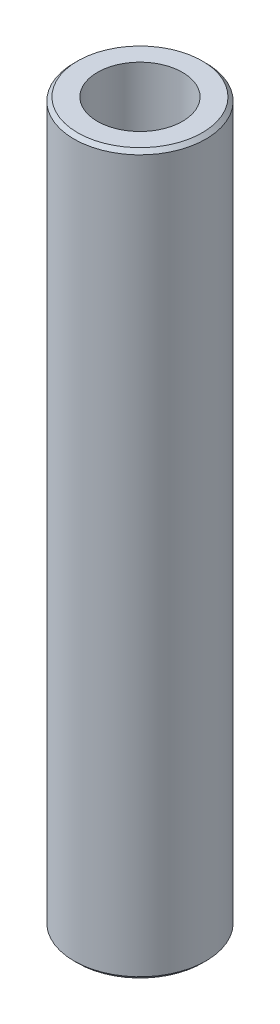
ISO-10303-21;
HEADER;
FILE_DESCRIPTION(('STEP AP214'),'2;1');
FILE_NAME('part.step','',(''),(''),'','','');
FILE_SCHEMA(('AUTOMOTIVE_DESIGN { 1 0 10303 214 1 1 1 1 }'));
ENDSEC;
DATA;
#1=APPLICATION_CONTEXT('core data for automotive mechanical design processes');
#2=APPLICATION_PROTOCOL_DEFINITION('international standard','automotive_design',2000,#1);
#3=PRODUCT_CONTEXT('',#1,'mechanical');
#4=PRODUCT('Part','Part','',(#3));
#5=PRODUCT_RELATED_PRODUCT_CATEGORY('part','',(#4));
#6=PRODUCT_DEFINITION_FORMATION('','',#4);
#7=PRODUCT_DEFINITION_CONTEXT('part definition',#1,'design');
#8=PRODUCT_DEFINITION('design','',#6,#7);
#9=PRODUCT_DEFINITION_SHAPE('','',#8);
#10=(LENGTH_UNIT() NAMED_UNIT(*) SI_UNIT(.MILLI.,.METRE.));
#11=(NAMED_UNIT(*) PLANE_ANGLE_UNIT() SI_UNIT($,.RADIAN.));
#12=(NAMED_UNIT(*) SI_UNIT($,.STERADIAN.) SOLID_ANGLE_UNIT());
#13=UNCERTAINTY_MEASURE_WITH_UNIT(LENGTH_MEASURE(1.E-05),#10,'distance_accuracy_value','');
#14=(GEOMETRIC_REPRESENTATION_CONTEXT(3) GLOBAL_UNCERTAINTY_ASSIGNED_CONTEXT((#13)) GLOBAL_UNIT_ASSIGNED_CONTEXT((#10,
#11,#12)) REPRESENTATION_CONTEXT('',''));
#15=CARTESIAN_POINT('',(0.,0.,0.));
#16=DIRECTION('',(0.,0.,1.));
#17=DIRECTION('',(1.,0.,0.));
#18=AXIS2_PLACEMENT_3D('',#15,#16,#17);
#19=CARTESIAN_POINT('',(0.,600.,0.));
#20=DIRECTION('',(0.,-1.,0.));
#21=DIRECTION('',(0.,0.,-1.));
#22=AXIS2_PLACEMENT_3D('',#19,#20,#21);
#23=CYLINDRICAL_SURFACE('',#22,55.);
#24=CARTESIAN_POINT('',(0.,596.954804541309,0.));
#25=DIRECTION('',(0.,1.,0.));
#26=DIRECTION('',(0.,0.,1.));
#27=AXIS2_PLACEMENT_3D('',#24,#25,#26);
#28=CIRCLE('',#27,55.);
#29=CARTESIAN_POINT('',(0.,596.954804541309,55.));
#30=VERTEX_POINT('',#29);
#31=EDGE_CURVE('E50',#30,#30,#28,.F.);
#32=ORIENTED_EDGE('',*,*,#31,.T.);
#33=EDGE_LOOP('',(#32));
#34=FACE_BOUND('',#33,.T.);
#35=CARTESIAN_POINT('',(0.,3.0451954586912,0.));
#36=DIRECTION('',(0.,1.,0.));
#37=DIRECTION('',(0.,0.,1.));
#38=AXIS2_PLACEMENT_3D('',#35,#36,#37);
#39=CIRCLE('',#38,55.);
#40=CARTESIAN_POINT('',(0.,3.0451954586912,55.));
#41=VERTEX_POINT('',#40);
#42=EDGE_CURVE('E51',#41,#41,#39,.T.);
#43=ORIENTED_EDGE('',*,*,#42,.T.);
#44=EDGE_LOOP('',(#43));
#45=FACE_BOUND('',#44,.T.);
#46=ADVANCED_FACE('F39',(#34,#45),#23,.T.);
#47=CARTESIAN_POINT('',(0.,600.,0.));
#48=DIRECTION('',(0.,1.,0.));
#49=DIRECTION('',(0.,0.,1.));
#50=AXIS2_PLACEMENT_3D('',#47,#48,#49);
#51=PLANE('',#50);
#52=CARTESIAN_POINT('',(0.,600.,0.));
#53=DIRECTION('',(0.,1.,0.));
#54=DIRECTION('',(0.,0.,1.));
#55=AXIS2_PLACEMENT_3D('',#52,#53,#54);
#56=CIRCLE('',#55,51.9548045413087);
#57=CARTESIAN_POINT('',(0.,600.,51.9548045413087));
#58=VERTEX_POINT('',#57);
#59=EDGE_CURVE('E54',#58,#58,#56,.T.);
#60=ORIENTED_EDGE('',*,*,#59,.T.);
#61=EDGE_LOOP('',(#60));
#62=FACE_BOUND('',#61,.T.);
#63=CARTESIAN_POINT('',(0.,600.,0.));
#64=DIRECTION('',(0.,1.,0.));
#65=DIRECTION('',(0.,0.,1.));
#66=AXIS2_PLACEMENT_3D('',#63,#64,#65);
#67=CIRCLE('',#66,35.4763558999587);
#68=CARTESIAN_POINT('',(0.,600.,35.4763558999587));
#69=VERTEX_POINT('',#68);
#70=EDGE_CURVE('E58',#69,#69,#67,.T.);
#71=ORIENTED_EDGE('',*,*,#70,.F.);
#72=EDGE_LOOP('',(#71));
#73=FACE_BOUND('',#72,.T.);
#74=ADVANCED_FACE('F69',(#62,#73),#51,.T.);
#75=CARTESIAN_POINT('',(0.,0.,0.));
#76=DIRECTION('',(0.,1.,0.));
#77=DIRECTION('',(0.,0.,1.));
#78=AXIS2_PLACEMENT_3D('',#75,#76,#77);
#79=PLANE('',#78);
#80=CARTESIAN_POINT('',(0.,0.,0.));
#81=DIRECTION('',(0.,1.,0.));
#82=DIRECTION('',(0.,0.,1.));
#83=AXIS2_PLACEMENT_3D('',#80,#81,#82);
#84=CIRCLE('',#83,51.9548045413088);
#85=CARTESIAN_POINT('',(0.,0.,51.9548045413088));
#86=VERTEX_POINT('',#85);
#87=EDGE_CURVE('E10',#86,#86,#84,.F.);
#88=ORIENTED_EDGE('',*,*,#87,.T.);
#89=EDGE_LOOP('',(#88));
#90=FACE_BOUND('',#89,.T.);
#91=CARTESIAN_POINT('',(0.,0.,0.));
#92=DIRECTION('',(0.,1.,0.));
#93=DIRECTION('',(0.,0.,1.));
#94=AXIS2_PLACEMENT_3D('',#91,#92,#93);
#95=CIRCLE('',#94,35.4763558999587);
#96=CARTESIAN_POINT('',(0.,0.,35.4763558999587));
#97=VERTEX_POINT('',#96);
#98=EDGE_CURVE('E63',#97,#97,#95,.T.);
#99=ORIENTED_EDGE('',*,*,#98,.T.);
#100=EDGE_LOOP('',(#99));
#101=FACE_BOUND('',#100,.T.);
#102=ADVANCED_FACE('F75',(#90,#101),#79,.F.);
#103=CARTESIAN_POINT('',(0.,600.,0.));
#104=DIRECTION('',(0.,-1.,0.));
#105=DIRECTION('',(0.,0.,-1.));
#106=AXIS2_PLACEMENT_3D('',#103,#104,#105);
#107=CYLINDRICAL_SURFACE('',#106,35.4763558999587);
#108=ORIENTED_EDGE('',*,*,#70,.T.);
#109=EDGE_LOOP('',(#108));
#110=FACE_BOUND('',#109,.T.);
#111=ORIENTED_EDGE('',*,*,#98,.F.);
#112=EDGE_LOOP('',(#111));
#113=FACE_BOUND('',#112,.T.);
#114=ADVANCED_FACE('F70',(#110,#113),#107,.F.);
#115=CARTESIAN_POINT('',(0.,600.,0.));
#116=DIRECTION('',(0.,-1.,0.));
#117=DIRECTION('',(0.,0.,-1.));
#118=AXIS2_PLACEMENT_3D('',#115,#116,#117);
#119=CONICAL_SURFACE('',#118,51.9548045413087,0.78539816339744);
#120=ORIENTED_EDGE('',*,*,#31,.F.);
#121=EDGE_LOOP('',(#120));
#122=FACE_BOUND('',#121,.T.);
#123=ORIENTED_EDGE('',*,*,#59,.F.);
#124=EDGE_LOOP('',(#123));
#125=FACE_BOUND('',#124,.T.);
#126=ADVANCED_FACE('F81',(#122,#125),#119,.T.);
#127=CARTESIAN_POINT('',(0.,3.0451954586912,0.));
#128=DIRECTION('',(0.,1.,0.));
#129=DIRECTION('',(0.,0.,1.));
#130=AXIS2_PLACEMENT_3D('',#127,#128,#129);
#131=CONICAL_SURFACE('',#130,55.,0.785398163397449);
#132=ORIENTED_EDGE('',*,*,#87,.F.);
#133=EDGE_LOOP('',(#132));
#134=FACE_BOUND('',#133,.T.);
#135=ORIENTED_EDGE('',*,*,#42,.F.);
#136=EDGE_LOOP('',(#135));
#137=FACE_BOUND('',#136,.T.);
#138=ADVANCED_FACE('F45',(#134,#137),#131,.T.);
#139=CLOSED_SHELL('',(#46,#74,#102,#114,#126,#138));
#140=MANIFOLD_SOLID_BREP('B2',#139);
#141=ADVANCED_BREP_SHAPE_REPRESENTATION('',(#18,#140),#14);
#142=SHAPE_DEFINITION_REPRESENTATION(#9,#141);
ENDSEC;
END-ISO-10303-21;
